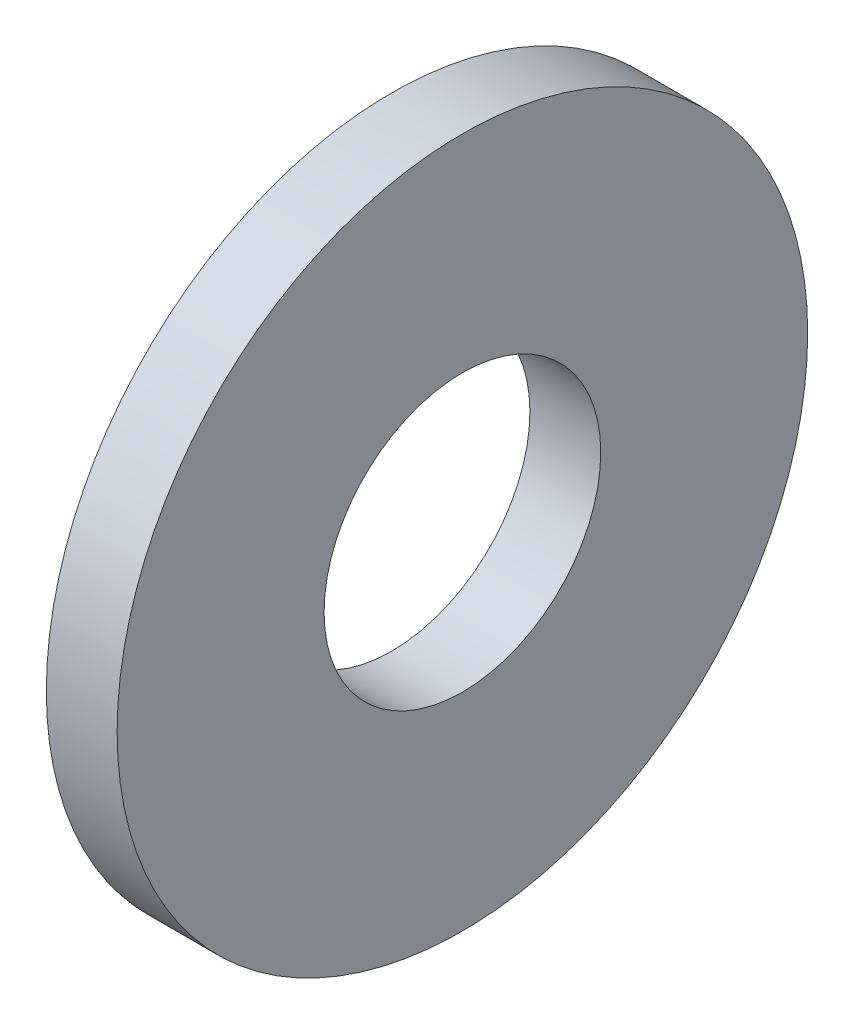
ISO-10303-21;
HEADER;
FILE_DESCRIPTION(('STEP AP214'),'2;1');
FILE_NAME('part.step','',(''),(''),'','','');
FILE_SCHEMA(('AUTOMOTIVE_DESIGN { 1 0 10303 214 1 1 1 1 }'));
ENDSEC;
DATA;
#1=APPLICATION_CONTEXT('core data for automotive mechanical design processes');
#2=APPLICATION_PROTOCOL_DEFINITION('international standard','automotive_design',2000,#1);
#3=PRODUCT_CONTEXT('',#1,'mechanical');
#4=PRODUCT('Part','Part','',(#3));
#5=PRODUCT_RELATED_PRODUCT_CATEGORY('part','',(#4));
#6=PRODUCT_DEFINITION_FORMATION('','',#4);
#7=PRODUCT_DEFINITION_CONTEXT('part definition',#1,'design');
#8=PRODUCT_DEFINITION('design','',#6,#7);
#9=PRODUCT_DEFINITION_SHAPE('','',#8);
#10=(LENGTH_UNIT() NAMED_UNIT(*) SI_UNIT(.MILLI.,.METRE.));
#11=(NAMED_UNIT(*) PLANE_ANGLE_UNIT() SI_UNIT($,.RADIAN.));
#12=(NAMED_UNIT(*) SI_UNIT($,.STERADIAN.) SOLID_ANGLE_UNIT());
#13=UNCERTAINTY_MEASURE_WITH_UNIT(LENGTH_MEASURE(1.E-05),#10,'distance_accuracy_value','');
#14=(GEOMETRIC_REPRESENTATION_CONTEXT(3) GLOBAL_UNCERTAINTY_ASSIGNED_CONTEXT((#13)) GLOBAL_UNIT_ASSIGNED_CONTEXT((#10,
#11,#12)) REPRESENTATION_CONTEXT('',''));
#15=CARTESIAN_POINT('',(0.,0.,0.));
#16=DIRECTION('',(0.,0.,1.));
#17=DIRECTION('',(1.,0.,0.));
#18=AXIS2_PLACEMENT_3D('',#15,#16,#17);
#19=CARTESIAN_POINT('',(-34.9249999999999,0.,0.));
#20=DIRECTION('',(-1.,0.,0.));
#21=DIRECTION('',(0.,0.,1.));
#22=AXIS2_PLACEMENT_3D('',#19,#20,#21);
#23=CYLINDRICAL_SURFACE('',#22,1.5875);
#24=CARTESIAN_POINT('',(0.,0.,0.));
#25=DIRECTION('',(-1.,0.,0.));
#26=DIRECTION('',(0.,0.,1.));
#27=AXIS2_PLACEMENT_3D('',#24,#25,#26);
#28=CIRCLE('',#27,1.5875);
#29=CARTESIAN_POINT('',(0.,0.,1.5875));
#30=VERTEX_POINT('',#29);
#31=EDGE_CURVE('E10',#30,#30,#28,.T.);
#32=ORIENTED_EDGE('',*,*,#31,.F.);
#33=EDGE_LOOP('',(#32));
#34=FACE_BOUND('',#33,.T.);
#35=CARTESIAN_POINT('',(-0.812800000000002,0.,0.));
#36=DIRECTION('',(-1.,0.,0.));
#37=DIRECTION('',(0.,0.,1.));
#38=AXIS2_PLACEMENT_3D('',#35,#36,#37);
#39=CIRCLE('',#38,1.5875);
#40=CARTESIAN_POINT('',(-0.812800000000002,0.,1.5875));
#41=VERTEX_POINT('',#40);
#42=EDGE_CURVE('E51',#41,#41,#39,.T.);
#43=ORIENTED_EDGE('',*,*,#42,.T.);
#44=EDGE_LOOP('',(#43));
#45=FACE_BOUND('',#44,.T.);
#46=ADVANCED_FACE('F37',(#34,#45),#23,.F.);
#47=CARTESIAN_POINT('',(0.,1.5875,0.));
#48=DIRECTION('',(-1.,0.,0.));
#49=DIRECTION('',(0.,0.,1.));
#50=AXIS2_PLACEMENT_3D('',#47,#48,#49);
#51=PLANE('',#50);
#52=CARTESIAN_POINT('',(0.,0.,0.));
#53=DIRECTION('',(-1.,0.,0.));
#54=DIRECTION('',(0.,0.,1.));
#55=AXIS2_PLACEMENT_3D('',#52,#53,#54);
#56=CIRCLE('',#55,3.9624);
#57=CARTESIAN_POINT('',(0.,0.,3.9624));
#58=VERTEX_POINT('',#57);
#59=EDGE_CURVE('E43',#58,#58,#56,.T.);
#60=ORIENTED_EDGE('',*,*,#59,.F.);
#61=EDGE_LOOP('',(#60));
#62=FACE_BOUND('',#61,.T.);
#63=ORIENTED_EDGE('',*,*,#31,.T.);
#64=EDGE_LOOP('',(#63));
#65=FACE_BOUND('',#64,.T.);
#66=ADVANCED_FACE('F66',(#62,#65),#51,.F.);
#67=CARTESIAN_POINT('',(-34.9249999999999,0.,0.));
#68=DIRECTION('',(-1.,0.,0.));
#69=DIRECTION('',(0.,0.,1.));
#70=AXIS2_PLACEMENT_3D('',#67,#68,#69);
#71=CYLINDRICAL_SURFACE('',#70,3.9624);
#72=CARTESIAN_POINT('',(-0.812800000000002,0.,0.));
#73=DIRECTION('',(-1.,0.,0.));
#74=DIRECTION('',(0.,0.,1.));
#75=AXIS2_PLACEMENT_3D('',#72,#73,#74);
#76=CIRCLE('',#75,3.9624);
#77=CARTESIAN_POINT('',(-0.812800000000002,0.,3.9624));
#78=VERTEX_POINT('',#77);
#79=EDGE_CURVE('E47',#78,#78,#76,.T.);
#80=ORIENTED_EDGE('',*,*,#79,.F.);
#81=EDGE_LOOP('',(#80));
#82=FACE_BOUND('',#81,.T.);
#83=ORIENTED_EDGE('',*,*,#59,.T.);
#84=EDGE_LOOP('',(#83));
#85=FACE_BOUND('',#84,.T.);
#86=ADVANCED_FACE('F61',(#82,#85),#71,.T.);
#87=CARTESIAN_POINT('',(-0.812800000000001,3.9624,0.));
#88=DIRECTION('',(1.,0.,0.));
#89=DIRECTION('',(0.,0.,-1.));
#90=AXIS2_PLACEMENT_3D('',#87,#88,#89);
#91=PLANE('',#90);
#92=ORIENTED_EDGE('',*,*,#42,.F.);
#93=EDGE_LOOP('',(#92));
#94=FACE_BOUND('',#93,.T.);
#95=ORIENTED_EDGE('',*,*,#79,.T.);
#96=EDGE_LOOP('',(#95));
#97=FACE_BOUND('',#96,.T.);
#98=ADVANCED_FACE('F58',(#94,#97),#91,.F.);
#99=CLOSED_SHELL('',(#46,#66,#86,#98));
#100=MANIFOLD_SOLID_BREP('B2',#99);
#101=ADVANCED_BREP_SHAPE_REPRESENTATION('',(#18,#100),#14);
#102=SHAPE_DEFINITION_REPRESENTATION(#9,#101);
ENDSEC;
END-ISO-10303-21;
